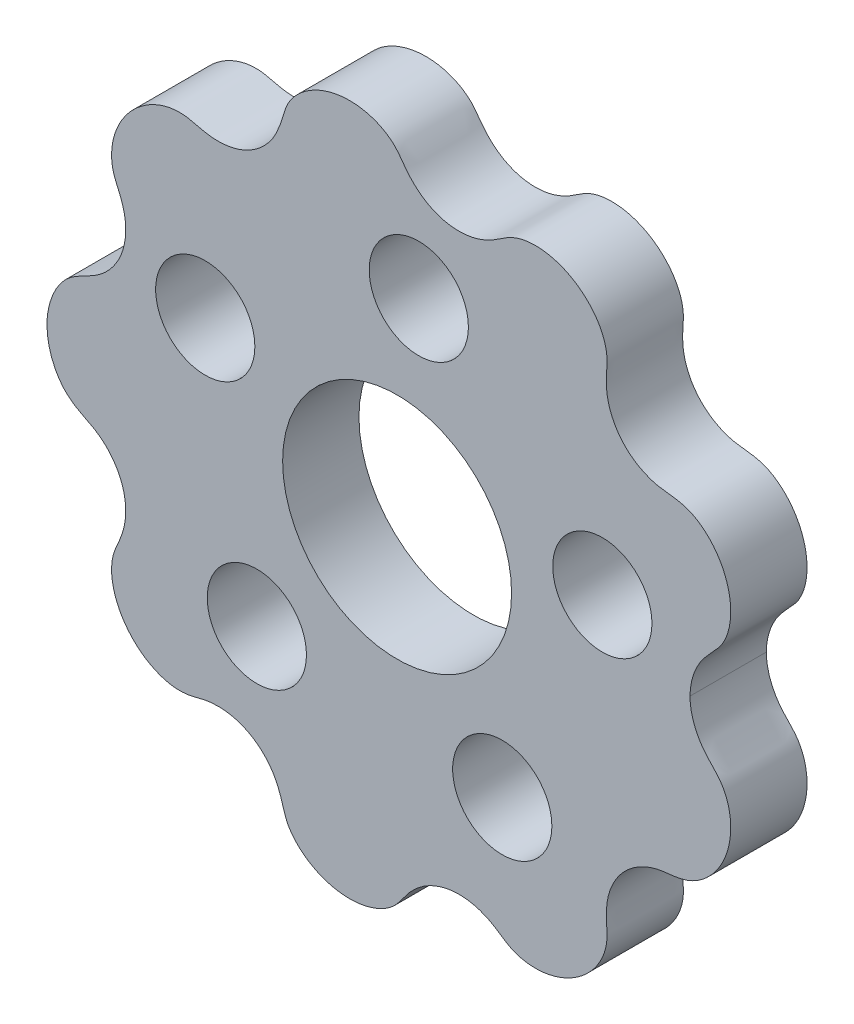
ISO-10303-21;
HEADER;
FILE_DESCRIPTION(('STEP AP214'),'2;1');
FILE_NAME('part.step','',(''),(''),'','','');
FILE_SCHEMA(('AUTOMOTIVE_DESIGN { 1 0 10303 214 1 1 1 1 }'));
ENDSEC;
DATA;
#1=APPLICATION_CONTEXT('core data for automotive mechanical design processes');
#2=APPLICATION_PROTOCOL_DEFINITION('international standard','automotive_design',2000,#1);
#3=PRODUCT_CONTEXT('',#1,'mechanical');
#4=PRODUCT('Part','Part','',(#3));
#5=PRODUCT_RELATED_PRODUCT_CATEGORY('part','',(#4));
#6=PRODUCT_DEFINITION_FORMATION('','',#4);
#7=PRODUCT_DEFINITION_CONTEXT('part definition',#1,'design');
#8=PRODUCT_DEFINITION('design','',#6,#7);
#9=PRODUCT_DEFINITION_SHAPE('','',#8);
#10=(LENGTH_UNIT() NAMED_UNIT(*) SI_UNIT(.MILLI.,.METRE.));
#11=(NAMED_UNIT(*) PLANE_ANGLE_UNIT() SI_UNIT($,.RADIAN.));
#12=(NAMED_UNIT(*) SI_UNIT($,.STERADIAN.) SOLID_ANGLE_UNIT());
#13=UNCERTAINTY_MEASURE_WITH_UNIT(LENGTH_MEASURE(1.E-05),#10,'distance_accuracy_value','');
#14=(GEOMETRIC_REPRESENTATION_CONTEXT(3) GLOBAL_UNCERTAINTY_ASSIGNED_CONTEXT((#13)) GLOBAL_UNIT_ASSIGNED_CONTEXT((#10,
#11,#12)) REPRESENTATION_CONTEXT('',''));
#15=CARTESIAN_POINT('',(0.,0.,0.));
#16=DIRECTION('',(0.,0.,1.));
#17=DIRECTION('',(1.,0.,0.));
#18=AXIS2_PLACEMENT_3D('',#15,#16,#17);
#19=CARTESIAN_POINT('',(0.0149632696059703,17.3061647003997,4.));
#20=DIRECTION('',(0.,0.,1.));
#21=DIRECTION('',(1.,0.,0.));
#22=AXIS2_PLACEMENT_3D('',#19,#20,#21);
#23=PLANE('',#22);
#24=CARTESIAN_POINT('',(0.,0.,4.));
#25=DIRECTION('',(0.,0.,1.));
#26=DIRECTION('',(1.,0.,0.));
#27=AXIS2_PLACEMENT_3D('',#24,#25,#26);
#28=CIRCLE('',#27,6.);
#29=CARTESIAN_POINT('',(6.,0.,4.));
#30=VERTEX_POINT('',#29);
#31=EDGE_CURVE('E141',#30,#30,#28,.T.);
#32=ORIENTED_EDGE('',*,*,#31,.F.);
#33=EDGE_LOOP('',(#32));
#34=FACE_BOUND('',#33,.T.);
#35=CARTESIAN_POINT('',(-7.35061863359657,-8.18342261547226,4.));
#36=DIRECTION('',(0.,0.,1.));
#37=DIRECTION('',(1.,0.,0.));
#38=AXIS2_PLACEMENT_3D('',#35,#36,#37);
#39=CIRCLE('',#38,2.6);
#40=CARTESIAN_POINT('',(-4.75061863359657,-8.18342261547226,4.));
#41=VERTEX_POINT('',#40);
#42=EDGE_CURVE('E121',#41,#41,#39,.T.);
#43=ORIENTED_EDGE('',*,*,#42,.F.);
#44=EDGE_LOOP('',(#43));
#45=FACE_BOUND('',#44,.T.);
#46=CARTESIAN_POINT('',(10.7568705204001,2.29994274001504,4.));
#47=DIRECTION('',(0.,0.,1.));
#48=DIRECTION('',(1.,0.,0.));
#49=AXIS2_PLACEMENT_3D('',#46,#47,#48);
#50=CIRCLE('',#49,2.6);
#51=CARTESIAN_POINT('',(13.3568705204001,2.29994274001504,4.));
#52=VERTEX_POINT('',#51);
#53=EDGE_CURVE('E99',#52,#52,#50,.T.);
#54=ORIENTED_EDGE('',*,*,#53,.F.);
#55=EDGE_LOOP('',(#54));
#56=FACE_BOUND('',#55,.T.);
#57=CARTESIAN_POINT('',(1.13668026709748,10.9411131961237,4.));
#58=DIRECTION('',(0.,0.,1.));
#59=DIRECTION('',(1.,0.,0.));
#60=AXIS2_PLACEMENT_3D('',#57,#58,#59);
#61=CIRCLE('',#60,2.6);
#62=CARTESIAN_POINT('',(3.73668026709748,10.9411131961237,4.));
#63=VERTEX_POINT('',#62);
#64=EDGE_CURVE('E106',#63,#63,#61,.T.);
#65=ORIENTED_EDGE('',*,*,#64,.F.);
#66=EDGE_LOOP('',(#65));
#67=FACE_BOUND('',#66,.T.);
#68=CARTESIAN_POINT('',(-10.0543634809925,4.46203708994939,4.));
#69=DIRECTION('',(0.,0.,1.));
#70=DIRECTION('',(1.,0.,0.));
#71=AXIS2_PLACEMENT_3D('',#68,#69,#70);
#72=CIRCLE('',#71,2.6);
#73=CARTESIAN_POINT('',(-7.45436348099252,4.46203708994939,4.));
#74=VERTEX_POINT('',#73);
#75=EDGE_CURVE('E105',#74,#74,#72,.T.);
#76=ORIENTED_EDGE('',*,*,#75,.F.);
#77=EDGE_LOOP('',(#76));
#78=FACE_BOUND('',#77,.T.);
#79=CARTESIAN_POINT('',(5.51143132709153,-9.5196704106158,4.));
#80=DIRECTION('',(0.,0.,1.));
#81=DIRECTION('',(1.,0.,0.));
#82=AXIS2_PLACEMENT_3D('',#79,#80,#81);
#83=CIRCLE('',#82,2.6);
#84=CARTESIAN_POINT('',(8.11143132709153,-9.5196704106158,4.));
#85=VERTEX_POINT('',#84);
#86=EDGE_CURVE('E122',#85,#85,#83,.T.);
#87=ORIENTED_EDGE('',*,*,#86,.F.);
#88=EDGE_LOOP('',(#87));
#89=FACE_BOUND('',#88,.T.);
#90=CARTESIAN_POINT('',(-18.3499958671797,4.36521029123377E-10,4.));
#91=CARTESIAN_POINT('',(-18.3472075883103,-0.621463833027231,4.));
#92=CARTESIAN_POINT('',(-18.1230848939045,-1.56911128138807,4.));
#93=CARTESIAN_POINT('',(-17.3903551611748,-2.60831048286185,4.));
#94=CARTESIAN_POINT('',(-16.6298818088159,-3.11017690195279,4.));
#95=CARTESIAN_POINT('',(-15.6965358470833,-3.52548633805394,4.));
#96=CARTESIAN_POINT('',(-14.9366628559457,-4.23017235356846,4.));
#97=CARTESIAN_POINT('',(-14.4096032442145,-5.1198971294211,4.));
#98=CARTESIAN_POINT('',(-14.1803657531017,-6.13047695211028,4.));
#99=CARTESIAN_POINT('',(-14.2562236507019,-7.16057651240113,4.));
#100=CARTESIAN_POINT('',(-14.5767256367909,-7.96054520045275,4.));
#101=CARTESIAN_POINT('',(-14.8394790896166,-8.53274555294691,4.));
#102=CARTESIAN_POINT('',(-14.9814711848277,-9.13093896628684,4.));
#103=CARTESIAN_POINT('',(-14.9652588230725,-9.91903358869605,4.));
#104=CARTESIAN_POINT('',(-14.692597481392,-10.8259257193041,4.));
#105=CARTESIAN_POINT('',(-14.2103844168312,-11.6434092298323,4.));
#106=CARTESIAN_POINT('',(-13.552575443106,-12.3285236870818,4.));
#107=CARTESIAN_POINT('',(-12.7558005310289,-12.8396729340155,4.));
#108=CARTESIAN_POINT('',(-11.8513434406799,-13.1362826774519,4.));
#109=CARTESIAN_POINT('',(-10.9320308429145,-13.1355956704325,4.));
#110=CARTESIAN_POINT('',(-9.9848053687996,-12.822843417879,4.));
#111=CARTESIAN_POINT('',(-8.94709111542244,-12.7997702633474,4.));
#112=CARTESIAN_POINT('',(-7.95082773619137,-13.0742746971628,4.));
#113=CARTESIAN_POINT('',(-7.08291629270541,-13.6407633904108,4.));
#114=CARTESIAN_POINT('',(-6.42266621620369,-14.4360116320474,4.));
#115=CARTESIAN_POINT('',(-6.0363023161889,-15.3980272870939,4.));
#116=CARTESIAN_POINT('',(-5.81688040405686,-16.3208891396805,4.));
#117=CARTESIAN_POINT('',(-5.23571504776021,-17.0642703466505,4.));
#118=CARTESIAN_POINT('',(-4.47903213892916,-17.631445856781,4.));
#119=CARTESIAN_POINT('',(-3.31001272731999,-18.1160072800211,4.));
#120=CARTESIAN_POINT('',(-2.01853566281588,-18.1794546690842,4.));
#121=CARTESIAN_POINT('',(-0.820712898901912,-17.7778456476489,4.));
#122=CARTESIAN_POINT('',(-0.0486434250680808,-17.2490420250637,4.));
#123=CARTESIAN_POINT('',(0.464360041581643,-16.4309021171191,4.));
#124=CARTESIAN_POINT('',(1.18826432600658,-15.6874995750516,4.));
#125=CARTESIAN_POINT('',(2.09718097026783,-15.1958843710072,4.));
#126=CARTESIAN_POINT('',(3.11467081487767,-14.997628133971,4.));
#127=CARTESIAN_POINT('',(4.14116450681149,-15.115361572511,4.));
#128=CARTESIAN_POINT('',(5.09319357485012,-15.5294289540511,4.));
#129=CARTESIAN_POINT('',(5.86214697675101,-16.14008839642,4.));
#130=CARTESIAN_POINT('',(6.74896361127391,-16.4118369183783,4.));
#131=CARTESIAN_POINT('',(7.69843337193625,-16.4148651373363,4.));
#132=CARTESIAN_POINT('',(8.922756059575,-16.1025294597898,4.));
#133=CARTESIAN_POINT('',(9.99221569659742,-15.3743492965221,4.));
#134=CARTESIAN_POINT('',(10.7165312180227,-14.3408179709458,4.));
#135=CARTESIAN_POINT('',(10.9763066656362,-13.596453338848,4.));
#136=CARTESIAN_POINT('',(11.0180222176999,-12.9853199072948,4.));
#137=CARTESIAN_POINT('',(10.9537861969972,-12.3457337419318,4.));
#138=CARTESIAN_POINT('',(10.9609941270693,-11.1395650840776,4.));
#139=CARTESIAN_POINT('',(11.5908938585771,-9.85843185303181,4.));
#140=CARTESIAN_POINT('',(12.687771995421,-9.02217450830818,4.));
#141=CARTESIAN_POINT('',(13.6571916153219,-8.65386755796314,4.));
#142=CARTESIAN_POINT('',(14.6672491473983,-8.60857555683282,4.));
#143=CARTESIAN_POINT('',(15.5412493930478,-8.34491732769173,4.));
#144=CARTESIAN_POINT('',(16.3076250576278,-7.77681993681116,4.));
#145=CARTESIAN_POINT('',(17.1001850221016,-6.79604256329175,4.));
#146=CARTESIAN_POINT('',(17.5159195106841,-5.57019537926817,4.));
#147=CARTESIAN_POINT('',(17.47969763452,-4.30744925169704,4.));
#148=CARTESIAN_POINT('',(17.2499436422637,-3.5538712771481,4.));
#149=CARTESIAN_POINT('',(16.9333776327377,-3.02376067251989,4.));
#150=CARTESIAN_POINT('',(16.5123156243203,-2.56878616725072,4.));
#151=CARTESIAN_POINT('',(15.6783695955331,-1.7060826903865,4.));
#152=CARTESIAN_POINT('',(15.3538390417052,-0.671439845525512,4.));
#153=CARTESIAN_POINT('',(15.3500099089858,3.3766072704951E-12,4.));
#154=B_SPLINE_CURVE_WITH_KNOTS('',3,(#90,#91,#92,#93,#94,#95,#96,#97,#98,#99,#100,#101,#102,
#103,#104,#105,#106,#107,#108,#109,#110,#111,#112,#113,#114,#115,#116,#117,#118,#119,#120,#121,
#122,#123,#124,#125,#126,#127,#128,#129,#130,#131,#132,#133,#134,#135,#136,#137,#138,#139,#140,
#141,#142,#143,#144,#145,#146,#147,#148,#149,#150,#151,#152,#153),.UNSPECIFIED.,.F.,.F.,(4,1,1,
1,1,1,1,1,1,1,1,1,1,1,1,1,1,1,1,1,1,1,1,1,1,1,1,1,1,1,1,1,1,1,1,1,1,1,1,1,1,1,1,1,1,1,1,1,1,1,1,
1,1,1,1,1,1,1,1,1,1,4),(0.12295788499203,0.146958734411323,0.15895915912097,0.170959583830617,
0.182960008540264,0.194960433249911,0.206960857959558,0.218961282669205,0.230961707378852,
0.242962132088499,0.248962344443322,0.254962556798146,0.266962981507793,0.278963406217439,
0.290963830927086,0.302964255636733,0.31496468034638,0.326965105056027,0.338965529765674,
0.350965954475321,0.362966379184968,0.374966803894615,0.386967228604262,0.398967653313908,
0.410968078023555,0.422968502733202,0.434968927442849,0.446969352152496,0.458969776862143,
0.482970626281437,0.494971050991084,0.506971475700731,0.518971900410378,0.530972325120025,
0.542972749829672,0.554973174539318,0.566973599248965,0.578974023958612,0.590974448668259,
0.602974873377906,0.614975298087553,0.6269757227972,0.650976572216494,0.662976996926141,
0.674977421635788,0.680977633990611,0.686977846345434,0.698978271055081,0.722979120474375,
0.734979545184022,0.746979969893669,0.758980394603316,0.770980819312963,0.78298124402261,
0.794981668732257,0.81898251815155,0.830982942861197,0.842983367570844,0.848983579925668,
0.854983792280491,0.866984216990138,0.890985066409432),.UNSPECIFIED.);
#155=CARTESIAN_POINT('',(-18.3499958671797,4.36521029123377E-10,4.));
#156=VERTEX_POINT('',#155);
#157=CARTESIAN_POINT('',(15.3500099089858,3.3766072704951E-12,4.));
#158=VERTEX_POINT('',#157);
#159=EDGE_CURVE('E73',#156,#158,#154,.T.);
#160=ORIENTED_EDGE('',*,*,#159,.T.);
#161=CARTESIAN_POINT('',(15.3500099089858,3.37709759669244E-12,4.));
#162=CARTESIAN_POINT('',(15.3538390417354,0.671439845518973,4.));
#163=CARTESIAN_POINT('',(15.6783695955965,1.70608269034593,4.));
#164=CARTESIAN_POINT('',(16.5123156243861,2.56878616716549,4.));
#165=CARTESIAN_POINT('',(16.9333776327767,3.02376067243395,4.));
#166=CARTESIAN_POINT('',(17.2499436422818,3.55387127706261,4.));
#167=CARTESIAN_POINT('',(17.4796976345193,4.30744925159982,4.));
#168=CARTESIAN_POINT('',(17.5159195106683,5.57019537914614,4.));
#169=CARTESIAN_POINT('',(17.1001850220899,6.7960425631417,4.));
#170=CARTESIAN_POINT('',(16.3076250576353,7.77681993664467,4.));
#171=CARTESIAN_POINT('',(15.5412493930761,8.34491732751807,4.));
#172=CARTESIAN_POINT('',(14.6672491474493,8.60857555668114,4.));
#173=CARTESIAN_POINT('',(13.6571916154011,8.65386755779692,4.));
#174=CARTESIAN_POINT('',(12.6877719955082,9.02217450810367,4.));
#175=CARTESIAN_POINT('',(11.5908938586552,9.85843185276877,4.));
#176=CARTESIAN_POINT('',(10.9609941271056,11.1395650837594,4.));
#177=CARTESIAN_POINT('',(10.9537861969599,12.3457337415861,4.));
#178=CARTESIAN_POINT('',(11.0180222176736,12.9853199069576,4.));
#179=CARTESIAN_POINT('',(10.9763066656623,13.5964533384998,4.));
#180=CARTESIAN_POINT('',(10.7165312181017,14.340817970598,4.));
#181=CARTESIAN_POINT('',(9.99221569675372,15.3743492961961,4.));
#182=CARTESIAN_POINT('',(8.92275605979827,16.1025294595117,4.));
#183=CARTESIAN_POINT('',(7.6984333722032,16.4148651371401,4.));
#184=CARTESIAN_POINT('',(6.74896361156717,16.4118369182558,4.));
#185=CARTESIAN_POINT('',(5.86214697699824,16.1400883964236,4.));
#186=CARTESIAN_POINT('',(5.09319357514644,15.5294289541063,4.));
#187=CARTESIAN_POINT('',(4.14116450718122,15.1153615724518,4.));
#188=CARTESIAN_POINT('',(3.11467081528252,14.997628133794,4.));
#189=CARTESIAN_POINT('',(2.09718097066644,15.1958843706905,4.));
#190=CARTESIAN_POINT('',(1.18826432636291,15.6874995746101,4.));
#191=CARTESIAN_POINT('',(0.464360041829151,16.4309021165458,4.));
#192=CARTESIAN_POINT('',(-0.048643424796105,17.2490420245649,4.));
#193=CARTESIAN_POINT('',(-0.820712898485275,17.7778456472665,4.));
#194=CARTESIAN_POINT('',(-2.01853566233216,18.1794546688529,4.));
#195=CARTESIAN_POINT('',(-3.31001272681049,18.1160072799529,4.));
#196=CARTESIAN_POINT('',(-4.47903213846628,17.6314458568796,4.));
#197=CARTESIAN_POINT('',(-5.23571504736128,17.0642703468802,4.));
#198=CARTESIAN_POINT('',(-5.81688040382542,16.3208891400164,4.));
#199=CARTESIAN_POINT('',(-6.03630231607845,15.3980272875747,4.));
#200=CARTESIAN_POINT('',(-6.42266621585878,14.4360116324635,4.));
#201=CARTESIAN_POINT('',(-7.08291629219453,13.6407633907146,4.));
#202=CARTESIAN_POINT('',(-7.95082773553604,13.0742746972869,4.));
#203=CARTESIAN_POINT('',(-8.94709111469007,12.7997702632651,4.));
#204=CARTESIAN_POINT('',(-9.9848053680482,12.8228434175435,4.));
#205=CARTESIAN_POINT('',(-10.9320308422547,13.1355956700599,4.));
#206=CARTESIAN_POINT('',(-11.8513434399518,13.1362826774138,4.));
#207=CARTESIAN_POINT('',(-12.7558005303552,12.839672934157,4.));
#208=CARTESIAN_POINT('',(-13.5525754425125,12.3285236873979,4.));
#209=CARTESIAN_POINT('',(-14.2103844163575,11.6434092302878,4.));
#210=CARTESIAN_POINT('',(-14.6925974810717,10.8259257198732,4.));
#211=CARTESIAN_POINT('',(-14.9652588229483,9.91903358933893,4.));
#212=CARTESIAN_POINT('',(-14.981471184906,9.13093896695401,4.));
#213=CARTESIAN_POINT('',(-14.8394790899096,8.53274555355313,4.));
#214=CARTESIAN_POINT('',(-14.5767256372502,7.96054520110293,4.));
#215=CARTESIAN_POINT('',(-14.2562236509219,7.1605765131778,4.));
#216=CARTESIAN_POINT('',(-14.1803657530443,6.13047695292723,4.));
#217=CARTESIAN_POINT('',(-14.4096032438416,5.11989713019244,4.));
#218=CARTESIAN_POINT('',(-14.9366628552935,4.23017235419205,4.));
#219=CARTESIAN_POINT('',(-15.6965358461933,3.52548633846858,4.));
#220=CARTESIAN_POINT('',(-16.6298818078741,3.11017690209147,4.));
#221=CARTESIAN_POINT('',(-17.3903551604867,2.60831048341928,4.));
#222=CARTESIAN_POINT('',(-18.1230848934904,1.5691112821608,4.));
#223=CARTESIAN_POINT('',(-18.3472075881439,0.621463833884692,4.));
#224=CARTESIAN_POINT('',(-18.3499958671758,4.36486942823514E-10,4.));
#225=B_SPLINE_CURVE_WITH_KNOTS('',3,(#161,#162,#163,#164,#165,#166,#167,#168,#169,#170,#171,
#172,#173,#174,#175,#176,#177,#178,#179,#180,#181,#182,#183,#184,#185,#186,#187,#188,#189,#190,
#191,#192,#193,#194,#195,#196,#197,#198,#199,#200,#201,#202,#203,#204,#205,#206,#207,#208,#209,
#210,#211,#212,#213,#214,#215,#216,#217,#218,#219,#220,#221,#222,#223,#224),.UNSPECIFIED.,.F.,
.F.,(4,1,1,1,1,1,1,1,1,1,1,1,1,1,1,1,1,1,1,1,1,1,1,1,1,1,1,1,1,1,1,1,1,1,1,1,1,1,1,1,1,1,1,1,1,
1,1,1,1,1,1,1,1,1,1,1,1,1,1,1,1,4),(0.122939125557366,0.146939974976179,0.158940399685586,
0.164940612040289,0.170940824394992,0.182941249104399,0.194941673813806,0.218942523232619,
0.230942947942025,0.242943372651432,0.254943797360838,0.266944222070245,0.278944646779652,
0.290945071489058,0.314945920907871,0.326946345617278,0.332946557971981,0.338946770326685,
0.350947195036091,0.362947619745498,0.386948469164311,0.398948893873718,0.410949318583124,
0.422949743292531,0.434950168001937,0.446950592711344,0.458951017420751,0.470951442130157,
0.482951866839564,0.49495229154897,0.506952716258377,0.518953140967784,0.53095356567719,
0.554954415096003,0.56695483980541,0.578955264514816,0.590955689224223,0.60295611393363,
0.614956538643036,0.626956963352443,0.63895738806185,0.650957812771256,0.662958237480663,
0.674958662190069,0.686959086899476,0.698959511608882,0.710959936318289,0.722960361027696,
0.734960785737102,0.746961210446509,0.758961635155915,0.764961847510619,0.770962059865322,
0.782962484574729,0.794962909284135,0.806963333993542,0.818963758702948,0.830964183412355,
0.842964608121762,0.854965032831168,0.866965457540575,0.890966306959388),.UNSPECIFIED.);
#226=EDGE_CURVE('E57',#158,#156,#225,.T.);
#227=ORIENTED_EDGE('',*,*,#226,.T.);
#228=EDGE_LOOP('',(#160,#227));
#229=FACE_BOUND('',#228,.T.);
#230=ADVANCED_FACE('F39',(#34,#45,#56,#67,#78,#89,#229),#23,.T.);
#231=CARTESIAN_POINT('',(0.0149632696059703,17.3061647003997,0.));
#232=DIRECTION('',(0.,0.,1.));
#233=DIRECTION('',(1.,0.,0.));
#234=AXIS2_PLACEMENT_3D('',#231,#232,#233);
#235=PLANE('',#234);
#236=CARTESIAN_POINT('',(0.,0.,0.));
#237=DIRECTION('',(0.,0.,1.));
#238=DIRECTION('',(1.,0.,0.));
#239=AXIS2_PLACEMENT_3D('',#236,#237,#238);
#240=CIRCLE('',#239,6.);
#241=CARTESIAN_POINT('',(6.,0.,0.));
#242=VERTEX_POINT('',#241);
#243=EDGE_CURVE('E137',#242,#242,#240,.T.);
#244=ORIENTED_EDGE('',*,*,#243,.T.);
#245=EDGE_LOOP('',(#244));
#246=FACE_BOUND('',#245,.T.);
#247=CARTESIAN_POINT('',(-7.35061863359657,-8.18342261547226,0.));
#248=DIRECTION('',(0.,0.,1.));
#249=DIRECTION('',(1.,0.,0.));
#250=AXIS2_PLACEMENT_3D('',#247,#248,#249);
#251=CIRCLE('',#250,2.6);
#252=CARTESIAN_POINT('',(-4.75061863359657,-8.18342261547226,0.));
#253=VERTEX_POINT('',#252);
#254=EDGE_CURVE('E133',#253,#253,#251,.T.);
#255=ORIENTED_EDGE('',*,*,#254,.T.);
#256=EDGE_LOOP('',(#255));
#257=FACE_BOUND('',#256,.T.);
#258=CARTESIAN_POINT('',(10.7568705204001,2.29994274001504,0.));
#259=DIRECTION('',(0.,0.,1.));
#260=DIRECTION('',(1.,0.,0.));
#261=AXIS2_PLACEMENT_3D('',#258,#259,#260);
#262=CIRCLE('',#261,2.6);
#263=CARTESIAN_POINT('',(13.3568705204001,2.29994274001504,0.));
#264=VERTEX_POINT('',#263);
#265=EDGE_CURVE('E110',#264,#264,#262,.T.);
#266=ORIENTED_EDGE('',*,*,#265,.T.);
#267=EDGE_LOOP('',(#266));
#268=FACE_BOUND('',#267,.T.);
#269=CARTESIAN_POINT('',(1.13668026709748,10.9411131961237,0.));
#270=DIRECTION('',(0.,0.,1.));
#271=DIRECTION('',(1.,0.,0.));
#272=AXIS2_PLACEMENT_3D('',#269,#270,#271);
#273=CIRCLE('',#272,2.6);
#274=CARTESIAN_POINT('',(3.73668026709748,10.9411131961237,0.));
#275=VERTEX_POINT('',#274);
#276=EDGE_CURVE('E101',#275,#275,#273,.T.);
#277=ORIENTED_EDGE('',*,*,#276,.T.);
#278=EDGE_LOOP('',(#277));
#279=FACE_BOUND('',#278,.T.);
#280=CARTESIAN_POINT('',(-10.0543634809925,4.46203708994939,0.));
#281=DIRECTION('',(0.,0.,1.));
#282=DIRECTION('',(1.,0.,0.));
#283=AXIS2_PLACEMENT_3D('',#280,#281,#282);
#284=CIRCLE('',#283,2.6);
#285=CARTESIAN_POINT('',(-7.45436348099252,4.46203708994939,0.));
#286=VERTEX_POINT('',#285);
#287=EDGE_CURVE('E126',#286,#286,#284,.T.);
#288=ORIENTED_EDGE('',*,*,#287,.T.);
#289=EDGE_LOOP('',(#288));
#290=FACE_BOUND('',#289,.T.);
#291=CARTESIAN_POINT('',(5.51143132709153,-9.5196704106158,0.));
#292=DIRECTION('',(0.,0.,1.));
#293=DIRECTION('',(1.,0.,0.));
#294=AXIS2_PLACEMENT_3D('',#291,#292,#293);
#295=CIRCLE('',#294,2.6);
#296=CARTESIAN_POINT('',(8.11143132709153,-9.5196704106158,0.));
#297=VERTEX_POINT('',#296);
#298=EDGE_CURVE('E117',#297,#297,#295,.T.);
#299=ORIENTED_EDGE('',*,*,#298,.T.);
#300=EDGE_LOOP('',(#299));
#301=FACE_BOUND('',#300,.T.);
#302=CARTESIAN_POINT('',(15.3500099089858,3.37709759669244E-12,0.));
#303=CARTESIAN_POINT('',(15.3538390417354,0.671439845518973,0.));
#304=CARTESIAN_POINT('',(15.6783695955965,1.70608269034593,0.));
#305=CARTESIAN_POINT('',(16.5123156243861,2.56878616716549,0.));
#306=CARTESIAN_POINT('',(16.9333776327767,3.02376067243395,0.));
#307=CARTESIAN_POINT('',(17.2499436422818,3.55387127706261,0.));
#308=CARTESIAN_POINT('',(17.4796976345193,4.30744925159982,0.));
#309=CARTESIAN_POINT('',(17.5159195106683,5.57019537914614,0.));
#310=CARTESIAN_POINT('',(17.1001850220899,6.7960425631417,0.));
#311=CARTESIAN_POINT('',(16.3076250576353,7.77681993664467,0.));
#312=CARTESIAN_POINT('',(15.5412493930761,8.34491732751807,0.));
#313=CARTESIAN_POINT('',(14.6672491474493,8.60857555668114,0.));
#314=CARTESIAN_POINT('',(13.6571916154011,8.65386755779692,0.));
#315=CARTESIAN_POINT('',(12.6877719955082,9.02217450810367,0.));
#316=CARTESIAN_POINT('',(11.5908938586552,9.85843185276877,0.));
#317=CARTESIAN_POINT('',(10.9609941271056,11.1395650837594,0.));
#318=CARTESIAN_POINT('',(10.9537861969599,12.3457337415861,0.));
#319=CARTESIAN_POINT('',(11.0180222176736,12.9853199069576,0.));
#320=CARTESIAN_POINT('',(10.9763066656623,13.5964533384998,0.));
#321=CARTESIAN_POINT('',(10.7165312181017,14.340817970598,0.));
#322=CARTESIAN_POINT('',(9.99221569675372,15.3743492961961,0.));
#323=CARTESIAN_POINT('',(8.92275605979827,16.1025294595117,0.));
#324=CARTESIAN_POINT('',(7.6984333722032,16.4148651371401,0.));
#325=CARTESIAN_POINT('',(6.74896361156717,16.4118369182558,0.));
#326=CARTESIAN_POINT('',(5.86214697699824,16.1400883964236,0.));
#327=CARTESIAN_POINT('',(5.09319357514644,15.5294289541063,0.));
#328=CARTESIAN_POINT('',(4.14116450718122,15.1153615724518,0.));
#329=CARTESIAN_POINT('',(3.11467081528252,14.997628133794,0.));
#330=CARTESIAN_POINT('',(2.09718097066644,15.1958843706905,0.));
#331=CARTESIAN_POINT('',(1.18826432636291,15.6874995746101,0.));
#332=CARTESIAN_POINT('',(0.464360041829151,16.4309021165458,0.));
#333=CARTESIAN_POINT('',(-0.048643424796105,17.2490420245649,0.));
#334=CARTESIAN_POINT('',(-0.820712898485275,17.7778456472665,0.));
#335=CARTESIAN_POINT('',(-2.01853566233216,18.1794546688529,0.));
#336=CARTESIAN_POINT('',(-3.31001272681049,18.1160072799529,0.));
#337=CARTESIAN_POINT('',(-4.47903213846628,17.6314458568796,0.));
#338=CARTESIAN_POINT('',(-5.23571504736128,17.0642703468802,0.));
#339=CARTESIAN_POINT('',(-5.81688040382542,16.3208891400164,0.));
#340=CARTESIAN_POINT('',(-6.03630231607845,15.3980272875747,0.));
#341=CARTESIAN_POINT('',(-6.42266621585878,14.4360116324635,0.));
#342=CARTESIAN_POINT('',(-7.08291629219453,13.6407633907146,0.));
#343=CARTESIAN_POINT('',(-7.95082773553604,13.0742746972869,0.));
#344=CARTESIAN_POINT('',(-8.94709111469007,12.7997702632651,0.));
#345=CARTESIAN_POINT('',(-9.9848053680482,12.8228434175435,0.));
#346=CARTESIAN_POINT('',(-10.9320308422547,13.1355956700599,0.));
#347=CARTESIAN_POINT('',(-11.8513434399518,13.1362826774138,0.));
#348=CARTESIAN_POINT('',(-12.7558005303552,12.839672934157,0.));
#349=CARTESIAN_POINT('',(-13.5525754425125,12.3285236873979,0.));
#350=CARTESIAN_POINT('',(-14.2103844163575,11.6434092302878,0.));
#351=CARTESIAN_POINT('',(-14.6925974810717,10.8259257198732,0.));
#352=CARTESIAN_POINT('',(-14.9652588229483,9.91903358933893,0.));
#353=CARTESIAN_POINT('',(-14.981471184906,9.13093896695401,0.));
#354=CARTESIAN_POINT('',(-14.8394790899096,8.53274555355313,0.));
#355=CARTESIAN_POINT('',(-14.5767256372502,7.96054520110293,0.));
#356=CARTESIAN_POINT('',(-14.2562236509219,7.1605765131778,0.));
#357=CARTESIAN_POINT('',(-14.1803657530443,6.13047695292723,0.));
#358=CARTESIAN_POINT('',(-14.4096032438416,5.11989713019244,0.));
#359=CARTESIAN_POINT('',(-14.9366628552935,4.23017235419205,0.));
#360=CARTESIAN_POINT('',(-15.6965358461933,3.52548633846858,0.));
#361=CARTESIAN_POINT('',(-16.6298818078741,3.11017690209147,0.));
#362=CARTESIAN_POINT('',(-17.3903551604867,2.60831048341928,0.));
#363=CARTESIAN_POINT('',(-18.1230848934904,1.5691112821608,0.));
#364=CARTESIAN_POINT('',(-18.3472075881439,0.621463833884692,0.));
#365=CARTESIAN_POINT('',(-18.3499958671758,4.36486942823514E-10,0.));
#366=B_SPLINE_CURVE_WITH_KNOTS('',3,(#302,#303,#304,#305,#306,#307,#308,#309,#310,#311,#312,
#313,#314,#315,#316,#317,#318,#319,#320,#321,#322,#323,#324,#325,#326,#327,#328,#329,#330,#331,
#332,#333,#334,#335,#336,#337,#338,#339,#340,#341,#342,#343,#344,#345,#346,#347,#348,#349,#350,
#351,#352,#353,#354,#355,#356,#357,#358,#359,#360,#361,#362,#363,#364,#365),.UNSPECIFIED.,.F.,
.F.,(4,1,1,1,1,1,1,1,1,1,1,1,1,1,1,1,1,1,1,1,1,1,1,1,1,1,1,1,1,1,1,1,1,1,1,1,1,1,1,1,1,1,1,1,1,
1,1,1,1,1,1,1,1,1,1,1,1,1,1,1,1,4),(0.122939125557366,0.146939974976179,0.158940399685586,
0.164940612040289,0.170940824394992,0.182941249104399,0.194941673813806,0.218942523232619,
0.230942947942025,0.242943372651432,0.254943797360838,0.266944222070245,0.278944646779652,
0.290945071489058,0.314945920907871,0.326946345617278,0.332946557971981,0.338946770326685,
0.350947195036091,0.362947619745498,0.386948469164311,0.398948893873718,0.410949318583124,
0.422949743292531,0.434950168001937,0.446950592711344,0.458951017420751,0.470951442130157,
0.482951866839564,0.49495229154897,0.506952716258377,0.518953140967784,0.53095356567719,
0.554954415096003,0.56695483980541,0.578955264514816,0.590955689224223,0.60295611393363,
0.614956538643036,0.626956963352443,0.63895738806185,0.650957812771256,0.662958237480663,
0.674958662190069,0.686959086899476,0.698959511608882,0.710959936318289,0.722960361027696,
0.734960785737102,0.746961210446509,0.758961635155915,0.764961847510619,0.770962059865322,
0.782962484574729,0.794962909284135,0.806963333993542,0.818963758702948,0.830964183412355,
0.842964608121762,0.854965032831168,0.866965457540575,0.890966306959388),.UNSPECIFIED.);
#367=CARTESIAN_POINT('',(15.3500099089858,3.3766072704951E-12,0.));
#368=VERTEX_POINT('',#367);
#369=CARTESIAN_POINT('',(-18.3499958671797,4.36521029123377E-10,0.));
#370=VERTEX_POINT('',#369);
#371=EDGE_CURVE('E11',#368,#370,#366,.T.);
#372=ORIENTED_EDGE('',*,*,#371,.F.);
#373=CARTESIAN_POINT('',(-18.3499958671797,4.36521029123377E-10,0.));
#374=CARTESIAN_POINT('',(-18.3472075883103,-0.621463833027231,0.));
#375=CARTESIAN_POINT('',(-18.1230848939045,-1.56911128138807,0.));
#376=CARTESIAN_POINT('',(-17.3903551611748,-2.60831048286185,0.));
#377=CARTESIAN_POINT('',(-16.6298818088159,-3.11017690195279,0.));
#378=CARTESIAN_POINT('',(-15.6965358470833,-3.52548633805394,0.));
#379=CARTESIAN_POINT('',(-14.9366628559457,-4.23017235356846,0.));
#380=CARTESIAN_POINT('',(-14.4096032442145,-5.1198971294211,0.));
#381=CARTESIAN_POINT('',(-14.1803657531017,-6.13047695211028,0.));
#382=CARTESIAN_POINT('',(-14.2562236507019,-7.16057651240113,0.));
#383=CARTESIAN_POINT('',(-14.5767256367909,-7.96054520045275,0.));
#384=CARTESIAN_POINT('',(-14.8394790896166,-8.53274555294691,0.));
#385=CARTESIAN_POINT('',(-14.9814711848277,-9.13093896628684,0.));
#386=CARTESIAN_POINT('',(-14.9652588230725,-9.91903358869605,0.));
#387=CARTESIAN_POINT('',(-14.692597481392,-10.8259257193041,0.));
#388=CARTESIAN_POINT('',(-14.2103844168312,-11.6434092298323,0.));
#389=CARTESIAN_POINT('',(-13.552575443106,-12.3285236870818,0.));
#390=CARTESIAN_POINT('',(-12.7558005310289,-12.8396729340155,0.));
#391=CARTESIAN_POINT('',(-11.8513434406799,-13.1362826774519,0.));
#392=CARTESIAN_POINT('',(-10.9320308429145,-13.1355956704325,0.));
#393=CARTESIAN_POINT('',(-9.9848053687996,-12.822843417879,0.));
#394=CARTESIAN_POINT('',(-8.94709111542244,-12.7997702633474,0.));
#395=CARTESIAN_POINT('',(-7.95082773619137,-13.0742746971628,0.));
#396=CARTESIAN_POINT('',(-7.08291629270541,-13.6407633904108,0.));
#397=CARTESIAN_POINT('',(-6.42266621620369,-14.4360116320474,0.));
#398=CARTESIAN_POINT('',(-6.0363023161889,-15.3980272870939,0.));
#399=CARTESIAN_POINT('',(-5.81688040405686,-16.3208891396805,0.));
#400=CARTESIAN_POINT('',(-5.23571504776021,-17.0642703466505,0.));
#401=CARTESIAN_POINT('',(-4.47903213892916,-17.631445856781,0.));
#402=CARTESIAN_POINT('',(-3.31001272731999,-18.1160072800211,0.));
#403=CARTESIAN_POINT('',(-2.01853566281588,-18.1794546690842,0.));
#404=CARTESIAN_POINT('',(-0.820712898901912,-17.7778456476489,0.));
#405=CARTESIAN_POINT('',(-0.0486434250680808,-17.2490420250637,0.));
#406=CARTESIAN_POINT('',(0.464360041581643,-16.4309021171191,0.));
#407=CARTESIAN_POINT('',(1.18826432600658,-15.6874995750516,0.));
#408=CARTESIAN_POINT('',(2.09718097026783,-15.1958843710072,0.));
#409=CARTESIAN_POINT('',(3.11467081487767,-14.997628133971,0.));
#410=CARTESIAN_POINT('',(4.14116450681149,-15.115361572511,0.));
#411=CARTESIAN_POINT('',(5.09319357485012,-15.5294289540511,0.));
#412=CARTESIAN_POINT('',(5.86214697675101,-16.14008839642,0.));
#413=CARTESIAN_POINT('',(6.74896361127391,-16.4118369183783,0.));
#414=CARTESIAN_POINT('',(7.69843337193625,-16.4148651373363,0.));
#415=CARTESIAN_POINT('',(8.922756059575,-16.1025294597898,0.));
#416=CARTESIAN_POINT('',(9.99221569659742,-15.3743492965221,0.));
#417=CARTESIAN_POINT('',(10.7165312180227,-14.3408179709458,0.));
#418=CARTESIAN_POINT('',(10.9763066656362,-13.596453338848,0.));
#419=CARTESIAN_POINT('',(11.0180222176999,-12.9853199072948,0.));
#420=CARTESIAN_POINT('',(10.9537861969972,-12.3457337419318,0.));
#421=CARTESIAN_POINT('',(10.9609941270693,-11.1395650840776,0.));
#422=CARTESIAN_POINT('',(11.5908938585771,-9.85843185303181,0.));
#423=CARTESIAN_POINT('',(12.687771995421,-9.02217450830818,0.));
#424=CARTESIAN_POINT('',(13.6571916153219,-8.65386755796314,0.));
#425=CARTESIAN_POINT('',(14.6672491473983,-8.60857555683282,0.));
#426=CARTESIAN_POINT('',(15.5412493930478,-8.34491732769173,0.));
#427=CARTESIAN_POINT('',(16.3076250576278,-7.77681993681116,0.));
#428=CARTESIAN_POINT('',(17.1001850221016,-6.79604256329175,0.));
#429=CARTESIAN_POINT('',(17.5159195106841,-5.57019537926817,0.));
#430=CARTESIAN_POINT('',(17.47969763452,-4.30744925169704,0.));
#431=CARTESIAN_POINT('',(17.2499436422637,-3.5538712771481,0.));
#432=CARTESIAN_POINT('',(16.9333776327377,-3.02376067251989,0.));
#433=CARTESIAN_POINT('',(16.5123156243203,-2.56878616725072,0.));
#434=CARTESIAN_POINT('',(15.6783695955331,-1.7060826903865,0.));
#435=CARTESIAN_POINT('',(15.3538390417052,-0.671439845525512,0.));
#436=CARTESIAN_POINT('',(15.3500099089858,3.3766072704951E-12,0.));
#437=B_SPLINE_CURVE_WITH_KNOTS('',3,(#373,#374,#375,#376,#377,#378,#379,#380,#381,#382,#383,
#384,#385,#386,#387,#388,#389,#390,#391,#392,#393,#394,#395,#396,#397,#398,#399,#400,#401,#402,
#403,#404,#405,#406,#407,#408,#409,#410,#411,#412,#413,#414,#415,#416,#417,#418,#419,#420,#421,
#422,#423,#424,#425,#426,#427,#428,#429,#430,#431,#432,#433,#434,#435,#436),.UNSPECIFIED.,.F.,
.F.,(4,1,1,1,1,1,1,1,1,1,1,1,1,1,1,1,1,1,1,1,1,1,1,1,1,1,1,1,1,1,1,1,1,1,1,1,1,1,1,1,1,1,1,1,1,
1,1,1,1,1,1,1,1,1,1,1,1,1,1,1,1,4),(0.12295788499203,0.146958734411323,0.15895915912097,
0.170959583830617,0.182960008540264,0.194960433249911,0.206960857959558,0.218961282669205,
0.230961707378852,0.242962132088499,0.248962344443322,0.254962556798146,0.266962981507793,
0.278963406217439,0.290963830927086,0.302964255636733,0.31496468034638,0.326965105056027,
0.338965529765674,0.350965954475321,0.362966379184968,0.374966803894615,0.386967228604262,
0.398967653313908,0.410968078023555,0.422968502733202,0.434968927442849,0.446969352152496,
0.458969776862143,0.482970626281437,0.494971050991084,0.506971475700731,0.518971900410378,
0.530972325120025,0.542972749829672,0.554973174539318,0.566973599248965,0.578974023958612,
0.590974448668259,0.602974873377906,0.614975298087553,0.6269757227972,0.650976572216494,
0.662976996926141,0.674977421635788,0.680977633990611,0.686977846345434,0.698978271055081,
0.722979120474375,0.734979545184022,0.746979969893669,0.758980394603316,0.770980819312963,
0.78298124402261,0.794981668732257,0.81898251815155,0.830982942861197,0.842983367570844,
0.848983579925668,0.854983792280491,0.866984216990138,0.890985066409432),.UNSPECIFIED.);
#438=EDGE_CURVE('E50',#370,#368,#437,.T.);
#439=ORIENTED_EDGE('',*,*,#438,.F.);
#440=EDGE_LOOP('',(#372,#439));
#441=FACE_BOUND('',#440,.T.);
#442=ADVANCED_FACE('F41',(#246,#257,#268,#279,#290,#301,#441),#235,.F.);
#443=CARTESIAN_POINT('',(0.,0.,4.));
#444=DIRECTION('',(0.,0.,-1.));
#445=DIRECTION('',(-1.,0.,0.));
#446=AXIS2_PLACEMENT_3D('',#443,#444,#445);
#447=CYLINDRICAL_SURFACE('',#446,6.);
#448=ORIENTED_EDGE('',*,*,#31,.T.);
#449=EDGE_LOOP('',(#448));
#450=FACE_BOUND('',#449,.T.);
#451=ORIENTED_EDGE('',*,*,#243,.F.);
#452=EDGE_LOOP('',(#451));
#453=FACE_BOUND('',#452,.T.);
#454=ADVANCED_FACE('F155',(#450,#453),#447,.F.);
#455=CARTESIAN_POINT('',(-7.35061863359657,-8.18342261547226,0.));
#456=DIRECTION('',(0.,0.,1.));
#457=DIRECTION('',(1.,0.,0.));
#458=AXIS2_PLACEMENT_3D('',#455,#456,#457);
#459=CYLINDRICAL_SURFACE('',#458,2.6);
#460=ORIENTED_EDGE('',*,*,#254,.F.);
#461=EDGE_LOOP('',(#460));
#462=FACE_BOUND('',#461,.T.);
#463=ORIENTED_EDGE('',*,*,#42,.T.);
#464=EDGE_LOOP('',(#463));
#465=FACE_BOUND('',#464,.T.);
#466=ADVANCED_FACE('F161',(#462,#465),#459,.F.);
#467=CARTESIAN_POINT('',(10.7568705204001,2.29994274001504,0.));
#468=DIRECTION('',(0.,0.,1.));
#469=DIRECTION('',(1.,0.,0.));
#470=AXIS2_PLACEMENT_3D('',#467,#468,#469);
#471=CYLINDRICAL_SURFACE('',#470,2.6);
#472=ORIENTED_EDGE('',*,*,#265,.F.);
#473=EDGE_LOOP('',(#472));
#474=FACE_BOUND('',#473,.T.);
#475=ORIENTED_EDGE('',*,*,#53,.T.);
#476=EDGE_LOOP('',(#475));
#477=FACE_BOUND('',#476,.T.);
#478=ADVANCED_FACE('F193',(#474,#477),#471,.F.);
#479=CARTESIAN_POINT('',(1.13668026709748,10.9411131961237,0.));
#480=DIRECTION('',(0.,0.,1.));
#481=DIRECTION('',(1.,0.,0.));
#482=AXIS2_PLACEMENT_3D('',#479,#480,#481);
#483=CYLINDRICAL_SURFACE('',#482,2.6);
#484=ORIENTED_EDGE('',*,*,#276,.F.);
#485=EDGE_LOOP('',(#484));
#486=FACE_BOUND('',#485,.T.);
#487=ORIENTED_EDGE('',*,*,#64,.T.);
#488=EDGE_LOOP('',(#487));
#489=FACE_BOUND('',#488,.T.);
#490=ADVANCED_FACE('F189',(#486,#489),#483,.F.);
#491=CARTESIAN_POINT('',(-10.0543634809925,4.46203708994939,0.));
#492=DIRECTION('',(0.,0.,1.));
#493=DIRECTION('',(1.,0.,0.));
#494=AXIS2_PLACEMENT_3D('',#491,#492,#493);
#495=CYLINDRICAL_SURFACE('',#494,2.6);
#496=ORIENTED_EDGE('',*,*,#287,.F.);
#497=EDGE_LOOP('',(#496));
#498=FACE_BOUND('',#497,.T.);
#499=ORIENTED_EDGE('',*,*,#75,.T.);
#500=EDGE_LOOP('',(#499));
#501=FACE_BOUND('',#500,.T.);
#502=ADVANCED_FACE('F180',(#498,#501),#495,.F.);
#503=CARTESIAN_POINT('',(5.51143132709153,-9.5196704106158,0.));
#504=DIRECTION('',(0.,0.,1.));
#505=DIRECTION('',(1.,0.,0.));
#506=AXIS2_PLACEMENT_3D('',#503,#504,#505);
#507=CYLINDRICAL_SURFACE('',#506,2.6);
#508=ORIENTED_EDGE('',*,*,#298,.F.);
#509=EDGE_LOOP('',(#508));
#510=FACE_BOUND('',#509,.T.);
#511=ORIENTED_EDGE('',*,*,#86,.T.);
#512=EDGE_LOOP('',(#511));
#513=FACE_BOUND('',#512,.T.);
#514=ADVANCED_FACE('F177',(#510,#513),#507,.F.);
#515=CARTESIAN_POINT('',(15.3500099089858,3.37709759669244E-12,-16.));
#516=CARTESIAN_POINT('',(15.3538390417354,0.671439845518973,-16.));
#517=CARTESIAN_POINT('',(15.6783695955965,1.70608269034593,-16.));
#518=CARTESIAN_POINT('',(16.5123156243861,2.56878616716549,-16.));
#519=CARTESIAN_POINT('',(16.9333776327767,3.02376067243395,-16.));
#520=CARTESIAN_POINT('',(17.2499436422818,3.55387127706261,-16.));
#521=CARTESIAN_POINT('',(17.4796976345193,4.30744925159982,-16.));
#522=CARTESIAN_POINT('',(17.5159195106683,5.57019537914614,-16.));
#523=CARTESIAN_POINT('',(17.1001850220899,6.7960425631417,-16.));
#524=CARTESIAN_POINT('',(16.3076250576353,7.77681993664467,-16.));
#525=CARTESIAN_POINT('',(15.5412493930761,8.34491732751807,-16.));
#526=CARTESIAN_POINT('',(14.6672491474493,8.60857555668114,-16.));
#527=CARTESIAN_POINT('',(13.6571916154011,8.65386755779692,-16.));
#528=CARTESIAN_POINT('',(12.6877719955082,9.02217450810367,-16.));
#529=CARTESIAN_POINT('',(11.5908938586552,9.85843185276877,-16.));
#530=CARTESIAN_POINT('',(10.9609941271056,11.1395650837594,-16.));
#531=CARTESIAN_POINT('',(10.9537861969599,12.3457337415861,-16.));
#532=CARTESIAN_POINT('',(11.0180222176736,12.9853199069576,-16.));
#533=CARTESIAN_POINT('',(10.9763066656623,13.5964533384998,-16.));
#534=CARTESIAN_POINT('',(10.7165312181017,14.340817970598,-16.));
#535=CARTESIAN_POINT('',(9.99221569675372,15.3743492961961,-16.));
#536=CARTESIAN_POINT('',(8.92275605979827,16.1025294595117,-16.));
#537=CARTESIAN_POINT('',(7.6984333722032,16.4148651371401,-16.));
#538=CARTESIAN_POINT('',(6.74896361156717,16.4118369182558,-16.));
#539=CARTESIAN_POINT('',(5.86214697699824,16.1400883964236,-16.));
#540=CARTESIAN_POINT('',(5.09319357514644,15.5294289541063,-16.));
#541=CARTESIAN_POINT('',(4.14116450718122,15.1153615724518,-16.));
#542=CARTESIAN_POINT('',(3.11467081528252,14.997628133794,-16.));
#543=CARTESIAN_POINT('',(2.09718097066644,15.1958843706905,-16.));
#544=CARTESIAN_POINT('',(1.18826432636291,15.6874995746101,-16.));
#545=CARTESIAN_POINT('',(0.464360041829151,16.4309021165458,-16.));
#546=CARTESIAN_POINT('',(-0.048643424796105,17.2490420245649,-16.));
#547=CARTESIAN_POINT('',(-0.820712898485275,17.7778456472665,-16.));
#548=CARTESIAN_POINT('',(-2.01853566233216,18.1794546688529,-16.));
#549=CARTESIAN_POINT('',(-3.31001272681049,18.1160072799529,-16.));
#550=CARTESIAN_POINT('',(-4.47903213846628,17.6314458568796,-16.));
#551=CARTESIAN_POINT('',(-5.23571504736128,17.0642703468802,-16.));
#552=CARTESIAN_POINT('',(-5.81688040382542,16.3208891400164,-16.));
#553=CARTESIAN_POINT('',(-6.03630231607845,15.3980272875747,-16.));
#554=CARTESIAN_POINT('',(-6.42266621585878,14.4360116324635,-16.));
#555=CARTESIAN_POINT('',(-7.08291629219453,13.6407633907146,-16.));
#556=CARTESIAN_POINT('',(-7.95082773553604,13.0742746972869,-16.));
#557=CARTESIAN_POINT('',(-8.94709111469007,12.7997702632651,-16.));
#558=CARTESIAN_POINT('',(-9.9848053680482,12.8228434175435,-16.));
#559=CARTESIAN_POINT('',(-10.9320308422547,13.1355956700599,-16.));
#560=CARTESIAN_POINT('',(-11.8513434399518,13.1362826774138,-16.));
#561=CARTESIAN_POINT('',(-12.7558005303552,12.839672934157,-16.));
#562=CARTESIAN_POINT('',(-13.5525754425125,12.3285236873979,-16.));
#563=CARTESIAN_POINT('',(-14.2103844163575,11.6434092302878,-16.));
#564=CARTESIAN_POINT('',(-14.6925974810717,10.8259257198732,-16.));
#565=CARTESIAN_POINT('',(-14.9652588229483,9.91903358933893,-16.));
#566=CARTESIAN_POINT('',(-14.981471184906,9.13093896695401,-16.));
#567=CARTESIAN_POINT('',(-14.8394790899096,8.53274555355313,-16.));
#568=CARTESIAN_POINT('',(-14.5767256372502,7.96054520110293,-16.));
#569=CARTESIAN_POINT('',(-14.2562236509219,7.1605765131778,-16.));
#570=CARTESIAN_POINT('',(-14.1803657530443,6.13047695292723,-16.));
#571=CARTESIAN_POINT('',(-14.4096032438416,5.11989713019244,-16.));
#572=CARTESIAN_POINT('',(-14.9366628552935,4.23017235419205,-16.));
#573=CARTESIAN_POINT('',(-15.6965358461933,3.52548633846858,-16.));
#574=CARTESIAN_POINT('',(-16.6298818078741,3.11017690209147,-16.));
#575=CARTESIAN_POINT('',(-17.3903551604867,2.60831048341928,-16.));
#576=CARTESIAN_POINT('',(-18.1230848934904,1.5691112821608,-16.));
#577=CARTESIAN_POINT('',(-18.3472075881439,0.621463833884692,-16.));
#578=CARTESIAN_POINT('',(-18.3499958671758,4.36486942823514E-10,-16.));
#579=B_SPLINE_CURVE_WITH_KNOTS('',3,(#515,#516,#517,#518,#519,#520,#521,#522,#523,#524,#525,
#526,#527,#528,#529,#530,#531,#532,#533,#534,#535,#536,#537,#538,#539,#540,#541,#542,#543,#544,
#545,#546,#547,#548,#549,#550,#551,#552,#553,#554,#555,#556,#557,#558,#559,#560,#561,#562,#563,
#564,#565,#566,#567,#568,#569,#570,#571,#572,#573,#574,#575,#576,#577,#578),.UNSPECIFIED.,.F.,
.F.,(4,1,1,1,1,1,1,1,1,1,1,1,1,1,1,1,1,1,1,1,1,1,1,1,1,1,1,1,1,1,1,1,1,1,1,1,1,1,1,1,1,1,1,1,1,
1,1,1,1,1,1,1,1,1,1,1,1,1,1,1,1,4),(0.122939125557366,0.146939974976179,0.158940399685586,
0.164940612040289,0.170940824394992,0.182941249104399,0.194941673813806,0.218942523232619,
0.230942947942025,0.242943372651432,0.254943797360838,0.266944222070245,0.278944646779652,
0.290945071489058,0.314945920907871,0.326946345617278,0.332946557971981,0.338946770326685,
0.350947195036091,0.362947619745498,0.386948469164311,0.398948893873718,0.410949318583124,
0.422949743292531,0.434950168001937,0.446950592711344,0.458951017420751,0.470951442130157,
0.482951866839564,0.49495229154897,0.506952716258377,0.518953140967784,0.53095356567719,
0.554954415096003,0.56695483980541,0.578955264514816,0.590955689224223,0.60295611393363,
0.614956538643036,0.626956963352443,0.63895738806185,0.650957812771256,0.662958237480663,
0.674958662190069,0.686959086899476,0.698959511608882,0.710959936318289,0.722960361027696,
0.734960785737102,0.746961210446509,0.758961635155915,0.764961847510619,0.770962059865322,
0.782962484574729,0.794962909284135,0.806963333993542,0.818963758702948,0.830964183412355,
0.842964608121762,0.854965032831168,0.866965457540575,0.890966306959388),.UNSPECIFIED.);
#580=DIRECTION('',(0.,0.,1.));
#581=VECTOR('',#580,1.);
#582=SURFACE_OF_LINEAR_EXTRUSION('',#579,#581);
#583=ORIENTED_EDGE('',*,*,#371,.T.);
#584=DIRECTION('',(0.,0.,1.));
#585=VECTOR('',#584,1.);
#586=CARTESIAN_POINT('',(-18.3499958671797,4.36521029123377E-10,-16.));
#587=LINE('',#586,#585);
#588=EDGE_CURVE('E64',#370,#156,#587,.T.);
#589=ORIENTED_EDGE('',*,*,#588,.T.);
#590=ORIENTED_EDGE('',*,*,#226,.F.);
#591=DIRECTION('',(0.,0.,1.));
#592=VECTOR('',#591,1.);
#593=CARTESIAN_POINT('',(15.3500099089858,3.3766072704951E-12,-16.));
#594=LINE('',#593,#592);
#595=EDGE_CURVE('E72',#368,#158,#594,.T.);
#596=ORIENTED_EDGE('',*,*,#595,.F.);
#597=EDGE_LOOP('',(#583,#589,#590,#596));
#598=FACE_BOUND('',#597,.T.);
#599=ADVANCED_FACE('F68',(#598),#582,.T.);
#600=CARTESIAN_POINT('',(-18.3499958671797,4.36521029123377E-10,-16.));
#601=CARTESIAN_POINT('',(-18.3472075883103,-0.621463833027231,-16.));
#602=CARTESIAN_POINT('',(-18.1230848939045,-1.56911128138807,-16.));
#603=CARTESIAN_POINT('',(-17.3903551611748,-2.60831048286185,-16.));
#604=CARTESIAN_POINT('',(-16.6298818088159,-3.11017690195279,-16.));
#605=CARTESIAN_POINT('',(-15.6965358470833,-3.52548633805394,-16.));
#606=CARTESIAN_POINT('',(-14.9366628559457,-4.23017235356846,-16.));
#607=CARTESIAN_POINT('',(-14.4096032442145,-5.1198971294211,-16.));
#608=CARTESIAN_POINT('',(-14.1803657531017,-6.13047695211028,-16.));
#609=CARTESIAN_POINT('',(-14.2562236507019,-7.16057651240113,-16.));
#610=CARTESIAN_POINT('',(-14.5767256367909,-7.96054520045275,-16.));
#611=CARTESIAN_POINT('',(-14.8394790896166,-8.53274555294691,-16.));
#612=CARTESIAN_POINT('',(-14.9814711848277,-9.13093896628684,-16.));
#613=CARTESIAN_POINT('',(-14.9652588230725,-9.91903358869605,-16.));
#614=CARTESIAN_POINT('',(-14.692597481392,-10.8259257193041,-16.));
#615=CARTESIAN_POINT('',(-14.2103844168312,-11.6434092298323,-16.));
#616=CARTESIAN_POINT('',(-13.552575443106,-12.3285236870818,-16.));
#617=CARTESIAN_POINT('',(-12.7558005310289,-12.8396729340155,-16.));
#618=CARTESIAN_POINT('',(-11.8513434406799,-13.1362826774519,-16.));
#619=CARTESIAN_POINT('',(-10.9320308429145,-13.1355956704325,-16.));
#620=CARTESIAN_POINT('',(-9.9848053687996,-12.822843417879,-16.));
#621=CARTESIAN_POINT('',(-8.94709111542244,-12.7997702633474,-16.));
#622=CARTESIAN_POINT('',(-7.95082773619137,-13.0742746971628,-16.));
#623=CARTESIAN_POINT('',(-7.08291629270541,-13.6407633904108,-16.));
#624=CARTESIAN_POINT('',(-6.42266621620369,-14.4360116320474,-16.));
#625=CARTESIAN_POINT('',(-6.0363023161889,-15.3980272870939,-16.));
#626=CARTESIAN_POINT('',(-5.81688040405686,-16.3208891396805,-16.));
#627=CARTESIAN_POINT('',(-5.23571504776021,-17.0642703466505,-16.));
#628=CARTESIAN_POINT('',(-4.47903213892916,-17.631445856781,-16.));
#629=CARTESIAN_POINT('',(-3.31001272731999,-18.1160072800211,-16.));
#630=CARTESIAN_POINT('',(-2.01853566281588,-18.1794546690842,-16.));
#631=CARTESIAN_POINT('',(-0.820712898901912,-17.7778456476489,-16.));
#632=CARTESIAN_POINT('',(-0.0486434250680808,-17.2490420250637,-16.));
#633=CARTESIAN_POINT('',(0.464360041581643,-16.4309021171191,-16.));
#634=CARTESIAN_POINT('',(1.18826432600658,-15.6874995750516,-16.));
#635=CARTESIAN_POINT('',(2.09718097026783,-15.1958843710072,-16.));
#636=CARTESIAN_POINT('',(3.11467081487767,-14.997628133971,-16.));
#637=CARTESIAN_POINT('',(4.14116450681149,-15.115361572511,-16.));
#638=CARTESIAN_POINT('',(5.09319357485012,-15.5294289540511,-16.));
#639=CARTESIAN_POINT('',(5.86214697675101,-16.14008839642,-16.));
#640=CARTESIAN_POINT('',(6.74896361127391,-16.4118369183783,-16.));
#641=CARTESIAN_POINT('',(7.69843337193625,-16.4148651373363,-16.));
#642=CARTESIAN_POINT('',(8.922756059575,-16.1025294597898,-16.));
#643=CARTESIAN_POINT('',(9.99221569659742,-15.3743492965221,-16.));
#644=CARTESIAN_POINT('',(10.7165312180227,-14.3408179709458,-16.));
#645=CARTESIAN_POINT('',(10.9763066656362,-13.596453338848,-16.));
#646=CARTESIAN_POINT('',(11.0180222176999,-12.9853199072948,-16.));
#647=CARTESIAN_POINT('',(10.9537861969972,-12.3457337419318,-16.));
#648=CARTESIAN_POINT('',(10.9609941270693,-11.1395650840776,-16.));
#649=CARTESIAN_POINT('',(11.5908938585771,-9.85843185303181,-16.));
#650=CARTESIAN_POINT('',(12.687771995421,-9.02217450830818,-16.));
#651=CARTESIAN_POINT('',(13.6571916153219,-8.65386755796314,-16.));
#652=CARTESIAN_POINT('',(14.6672491473983,-8.60857555683282,-16.));
#653=CARTESIAN_POINT('',(15.5412493930478,-8.34491732769173,-16.));
#654=CARTESIAN_POINT('',(16.3076250576278,-7.77681993681116,-16.));
#655=CARTESIAN_POINT('',(17.1001850221016,-6.79604256329175,-16.));
#656=CARTESIAN_POINT('',(17.5159195106841,-5.57019537926817,-16.));
#657=CARTESIAN_POINT('',(17.47969763452,-4.30744925169704,-16.));
#658=CARTESIAN_POINT('',(17.2499436422637,-3.5538712771481,-16.));
#659=CARTESIAN_POINT('',(16.9333776327377,-3.02376067251989,-16.));
#660=CARTESIAN_POINT('',(16.5123156243203,-2.56878616725072,-16.));
#661=CARTESIAN_POINT('',(15.6783695955331,-1.7060826903865,-16.));
#662=CARTESIAN_POINT('',(15.3538390417052,-0.671439845525512,-16.));
#663=CARTESIAN_POINT('',(15.3500099089858,3.3766072704951E-12,-16.));
#664=B_SPLINE_CURVE_WITH_KNOTS('',3,(#600,#601,#602,#603,#604,#605,#606,#607,#608,#609,#610,
#611,#612,#613,#614,#615,#616,#617,#618,#619,#620,#621,#622,#623,#624,#625,#626,#627,#628,#629,
#630,#631,#632,#633,#634,#635,#636,#637,#638,#639,#640,#641,#642,#643,#644,#645,#646,#647,#648,
#649,#650,#651,#652,#653,#654,#655,#656,#657,#658,#659,#660,#661,#662,#663),.UNSPECIFIED.,.F.,
.F.,(4,1,1,1,1,1,1,1,1,1,1,1,1,1,1,1,1,1,1,1,1,1,1,1,1,1,1,1,1,1,1,1,1,1,1,1,1,1,1,1,1,1,1,1,1,
1,1,1,1,1,1,1,1,1,1,1,1,1,1,1,1,4),(0.12295788499203,0.146958734411323,0.15895915912097,
0.170959583830617,0.182960008540264,0.194960433249911,0.206960857959558,0.218961282669205,
0.230961707378852,0.242962132088499,0.248962344443322,0.254962556798146,0.266962981507793,
0.278963406217439,0.290963830927086,0.302964255636733,0.31496468034638,0.326965105056027,
0.338965529765674,0.350965954475321,0.362966379184968,0.374966803894615,0.386967228604262,
0.398967653313908,0.410968078023555,0.422968502733202,0.434968927442849,0.446969352152496,
0.458969776862143,0.482970626281437,0.494971050991084,0.506971475700731,0.518971900410378,
0.530972325120025,0.542972749829672,0.554973174539318,0.566973599248965,0.578974023958612,
0.590974448668259,0.602974873377906,0.614975298087553,0.6269757227972,0.650976572216494,
0.662976996926141,0.674977421635788,0.680977633990611,0.686977846345434,0.698978271055081,
0.722979120474375,0.734979545184022,0.746979969893669,0.758980394603316,0.770980819312963,
0.78298124402261,0.794981668732257,0.81898251815155,0.830982942861197,0.842983367570844,
0.848983579925668,0.854983792280491,0.866984216990138,0.890985066409432),.UNSPECIFIED.);
#665=DIRECTION('',(0.,0.,1.));
#666=VECTOR('',#665,1.);
#667=SURFACE_OF_LINEAR_EXTRUSION('',#664,#666);
#668=ORIENTED_EDGE('',*,*,#438,.T.);
#669=ORIENTED_EDGE('',*,*,#595,.T.);
#670=ORIENTED_EDGE('',*,*,#159,.F.);
#671=ORIENTED_EDGE('',*,*,#588,.F.);
#672=EDGE_LOOP('',(#668,#669,#670,#671));
#673=FACE_BOUND('',#672,.T.);
#674=ADVANCED_FACE('F76',(#673),#667,.T.);
#675=CLOSED_SHELL('',(#230,#442,#454,#466,#478,#490,#502,#514,#599,#674));
#676=MANIFOLD_SOLID_BREP('B2',#675);
#677=ADVANCED_BREP_SHAPE_REPRESENTATION('',(#18,#676),#14);
#678=SHAPE_DEFINITION_REPRESENTATION(#9,#677);
ENDSEC;
END-ISO-10303-21;
